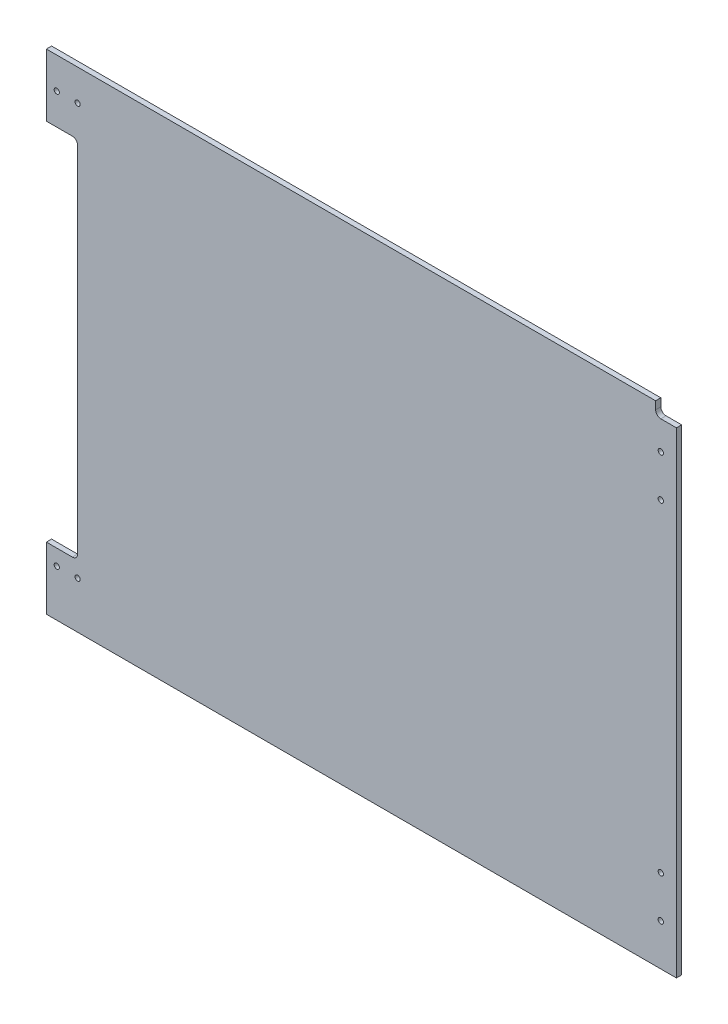
ISO-10303-21;
HEADER;
FILE_DESCRIPTION(('STEP AP214'),'2;1');
FILE_NAME('part.step','',(''),(''),'','','');
FILE_SCHEMA(('AUTOMOTIVE_DESIGN { 1 0 10303 214 1 1 1 1 }'));
ENDSEC;
DATA;
#1=APPLICATION_CONTEXT('core data for automotive mechanical design processes');
#2=APPLICATION_PROTOCOL_DEFINITION('international standard','automotive_design',2000,#1);
#3=PRODUCT_CONTEXT('',#1,'mechanical');
#4=PRODUCT('Part','Part','',(#3));
#5=PRODUCT_RELATED_PRODUCT_CATEGORY('part','',(#4));
#6=PRODUCT_DEFINITION_FORMATION('','',#4);
#7=PRODUCT_DEFINITION_CONTEXT('part definition',#1,'design');
#8=PRODUCT_DEFINITION('design','',#6,#7);
#9=PRODUCT_DEFINITION_SHAPE('','',#8);
#10=(LENGTH_UNIT() NAMED_UNIT(*) SI_UNIT(.MILLI.,.METRE.));
#11=(NAMED_UNIT(*) PLANE_ANGLE_UNIT() SI_UNIT($,.RADIAN.));
#12=(NAMED_UNIT(*) SI_UNIT($,.STERADIAN.) SOLID_ANGLE_UNIT());
#13=UNCERTAINTY_MEASURE_WITH_UNIT(LENGTH_MEASURE(1.E-05),#10,'distance_accuracy_value','');
#14=(GEOMETRIC_REPRESENTATION_CONTEXT(3) GLOBAL_UNCERTAINTY_ASSIGNED_CONTEXT((#13)) GLOBAL_UNIT_ASSIGNED_CONTEXT((#10,
#11,#12)) REPRESENTATION_CONTEXT('',''));
#15=CARTESIAN_POINT('',(0.,0.,0.));
#16=DIRECTION('',(0.,0.,1.));
#17=DIRECTION('',(1.,0.,0.));
#18=AXIS2_PLACEMENT_3D('',#15,#16,#17);
#19=CARTESIAN_POINT('',(0.,0.,6.35));
#20=DIRECTION('',(0.,0.,-1.));
#21=DIRECTION('',(-1.,0.,0.));
#22=AXIS2_PLACEMENT_3D('',#19,#20,#21);
#23=PLANE('',#22);
#24=CARTESIAN_POINT('',(-387.35,260.35,6.35));
#25=DIRECTION('',(0.,0.,1.));
#26=DIRECTION('',(1.,0.,0.));
#27=AXIS2_PLACEMENT_3D('',#24,#25,#26);
#28=CIRCLE('',#27,3.17499999999998);
#29=CARTESIAN_POINT('',(-384.175,260.35,6.35));
#30=VERTEX_POINT('',#29);
#31=EDGE_CURVE('E206',#30,#30,#28,.T.);
#32=ORIENTED_EDGE('',*,*,#31,.F.);
#33=EDGE_LOOP('',(#32));
#34=FACE_BOUND('',#33,.T.);
#35=CARTESIAN_POINT('',(-361.95,-241.3,6.35));
#36=DIRECTION('',(0.,0.,1.));
#37=DIRECTION('',(1.,0.,0.));
#38=AXIS2_PLACEMENT_3D('',#35,#36,#37);
#39=CIRCLE('',#38,3.17499999999998);
#40=CARTESIAN_POINT('',(-358.775,-241.3,6.35));
#41=VERTEX_POINT('',#40);
#42=EDGE_CURVE('E226',#41,#41,#39,.T.);
#43=ORIENTED_EDGE('',*,*,#42,.F.);
#44=EDGE_LOOP('',(#43));
#45=FACE_BOUND('',#44,.T.);
#46=CARTESIAN_POINT('',(349.25,247.65,6.35));
#47=DIRECTION('',(0.,0.,1.));
#48=DIRECTION('',(1.,0.,0.));
#49=AXIS2_PLACEMENT_3D('',#46,#47,#48);
#50=CIRCLE('',#49,3.26389999999999);
#51=CARTESIAN_POINT('',(352.5139,247.65,6.35));
#52=VERTEX_POINT('',#51);
#53=EDGE_CURVE('E242',#52,#52,#50,.T.);
#54=ORIENTED_EDGE('',*,*,#53,.F.);
#55=EDGE_LOOP('',(#54));
#56=FACE_BOUND('',#55,.T.);
#57=CARTESIAN_POINT('',(349.25,196.85,6.35));
#58=DIRECTION('',(0.,0.,1.));
#59=DIRECTION('',(1.,0.,0.));
#60=AXIS2_PLACEMENT_3D('',#57,#58,#59);
#61=CIRCLE('',#60,3.26389999999999);
#62=CARTESIAN_POINT('',(352.5139,196.85,6.35));
#63=VERTEX_POINT('',#62);
#64=EDGE_CURVE('E250',#63,#63,#61,.T.);
#65=ORIENTED_EDGE('',*,*,#64,.F.);
#66=EDGE_LOOP('',(#65));
#67=FACE_BOUND('',#66,.T.);
#68=CARTESIAN_POINT('',(349.25,-196.85,6.35));
#69=DIRECTION('',(0.,0.,1.));
#70=DIRECTION('',(1.,0.,0.));
#71=AXIS2_PLACEMENT_3D('',#68,#69,#70);
#72=CIRCLE('',#71,3.26389999999999);
#73=CARTESIAN_POINT('',(352.5139,-196.85,6.35));
#74=VERTEX_POINT('',#73);
#75=EDGE_CURVE('E258',#74,#74,#72,.T.);
#76=ORIENTED_EDGE('',*,*,#75,.F.);
#77=EDGE_LOOP('',(#76));
#78=FACE_BOUND('',#77,.T.);
#79=DIRECTION('',(0.,1.,0.));
#80=VECTOR('',#79,1.);
#81=CARTESIAN_POINT('',(368.3,-298.45,6.35));
#82=LINE('',#81,#80);
#83=CARTESIAN_POINT('',(368.3,-298.45,6.35));
#84=VERTEX_POINT('',#83);
#85=CARTESIAN_POINT('',(368.3,282.575,6.35));
#86=VERTEX_POINT('',#85);
#87=EDGE_CURVE('E328',#84,#86,#82,.T.);
#88=ORIENTED_EDGE('',*,*,#87,.T.);
#89=DIRECTION('',(1.,0.,0.));
#90=VECTOR('',#89,1.);
#91=CARTESIAN_POINT('',(368.3,282.575,6.35));
#92=LINE('',#91,#90);
#93=CARTESIAN_POINT('',(349.25,282.575,6.35));
#94=VERTEX_POINT('',#93);
#95=EDGE_CURVE('E190',#94,#86,#92,.T.);
#96=ORIENTED_EDGE('',*,*,#95,.F.);
#97=CARTESIAN_POINT('',(349.25,288.925,6.35));
#98=DIRECTION('',(0.,0.,1.));
#99=DIRECTION('',(-1.,0.,0.));
#100=AXIS2_PLACEMENT_3D('',#97,#98,#99);
#101=CIRCLE('',#100,6.35000000000002);
#102=CARTESIAN_POINT('',(342.9,288.925,6.35));
#103=VERTEX_POINT('',#102);
#104=EDGE_CURVE('E194',#103,#94,#101,.T.);
#105=ORIENTED_EDGE('',*,*,#104,.F.);
#106=DIRECTION('',(0.,-1.,0.));
#107=VECTOR('',#106,1.);
#108=CARTESIAN_POINT('',(342.9,298.45,6.35));
#109=LINE('',#108,#107);
#110=CARTESIAN_POINT('',(342.9,298.45,6.35));
#111=VERTEX_POINT('',#110);
#112=EDGE_CURVE('E167',#111,#103,#109,.T.);
#113=ORIENTED_EDGE('',*,*,#112,.F.);
#114=DIRECTION('',(-1.,0.,0.));
#115=VECTOR('',#114,1.);
#116=CARTESIAN_POINT('',(-368.3,298.45,6.35));
#117=LINE('',#116,#115);
#118=CARTESIAN_POINT('',(-400.05,298.45,6.35));
#119=VERTEX_POINT('',#118);
#120=EDGE_CURVE('E332',#111,#119,#117,.T.);
#121=ORIENTED_EDGE('',*,*,#120,.T.);
#122=DIRECTION('',(0.,-1.,0.));
#123=VECTOR('',#122,1.);
#124=CARTESIAN_POINT('',(-400.05,298.45,6.35));
#125=LINE('',#124,#123);
#126=CARTESIAN_POINT('',(-400.05,222.25,6.35));
#127=VERTEX_POINT('',#126);
#128=EDGE_CURVE('E301',#119,#127,#125,.T.);
#129=ORIENTED_EDGE('',*,*,#128,.T.);
#130=DIRECTION('',(1.,0.,0.));
#131=VECTOR('',#130,1.);
#132=CARTESIAN_POINT('',(-368.3,222.25,6.35));
#133=LINE('',#132,#131);
#134=CARTESIAN_POINT('',(-368.3,222.25,6.35));
#135=VERTEX_POINT('',#134);
#136=EDGE_CURVE('E305',#127,#135,#133,.T.);
#137=ORIENTED_EDGE('',*,*,#136,.T.);
#138=CARTESIAN_POINT('',(-368.3,215.9,6.34999999999999));
#139=DIRECTION('',(0.,0.,-1.));
#140=DIRECTION('',(-1.,0.,0.));
#141=AXIS2_PLACEMENT_3D('',#138,#139,#140);
#142=CIRCLE('',#141,6.35);
#143=CARTESIAN_POINT('',(-361.95,215.9,6.35));
#144=VERTEX_POINT('',#143);
#145=EDGE_CURVE('E363',#135,#144,#142,.T.);
#146=ORIENTED_EDGE('',*,*,#145,.T.);
#147=DIRECTION('',(0.,1.,0.));
#148=VECTOR('',#147,1.);
#149=CARTESIAN_POINT('',(-361.95,222.25,6.35));
#150=LINE('',#149,#148);
#151=CARTESIAN_POINT('',(-361.95,-215.9,6.35));
#152=VERTEX_POINT('',#151);
#153=EDGE_CURVE('E274',#152,#144,#150,.T.);
#154=ORIENTED_EDGE('',*,*,#153,.F.);
#155=CARTESIAN_POINT('',(-368.3,-215.9,6.35));
#156=DIRECTION('',(0.,0.,-1.));
#157=DIRECTION('',(-1.,0.,0.));
#158=AXIS2_PLACEMENT_3D('',#155,#156,#157);
#159=CIRCLE('',#158,6.35);
#160=CARTESIAN_POINT('',(-368.3,-222.25,6.35));
#161=VERTEX_POINT('',#160);
#162=EDGE_CURVE('E48',#152,#161,#159,.T.);
#163=ORIENTED_EDGE('',*,*,#162,.T.);
#164=DIRECTION('',(-1.,0.,0.));
#165=VECTOR('',#164,1.);
#166=CARTESIAN_POINT('',(-368.3,-222.25,6.35));
#167=LINE('',#166,#165);
#168=CARTESIAN_POINT('',(-400.05,-222.25,6.35));
#169=VERTEX_POINT('',#168);
#170=EDGE_CURVE('E279',#161,#169,#167,.T.);
#171=ORIENTED_EDGE('',*,*,#170,.T.);
#172=DIRECTION('',(0.,-1.,0.));
#173=VECTOR('',#172,1.);
#174=CARTESIAN_POINT('',(-400.05,-298.45,6.35));
#175=LINE('',#174,#173);
#176=CARTESIAN_POINT('',(-400.05,-298.45,6.35));
#177=VERTEX_POINT('',#176);
#178=EDGE_CURVE('E283',#169,#177,#175,.T.);
#179=ORIENTED_EDGE('',*,*,#178,.T.);
#180=DIRECTION('',(1.,0.,0.));
#181=VECTOR('',#180,1.);
#182=CARTESIAN_POINT('',(-368.3,-298.45,6.35));
#183=LINE('',#182,#181);
#184=EDGE_CURVE('E336',#177,#84,#183,.T.);
#185=ORIENTED_EDGE('',*,*,#184,.T.);
#186=EDGE_LOOP('',(#88,#96,#105,#113,#121,#129,#137,#146,#154,#163,#171,#179,#185));
#187=FACE_BOUND('',#186,.T.);
#188=CARTESIAN_POINT('',(349.25,-247.65,6.35));
#189=DIRECTION('',(0.,0.,1.));
#190=DIRECTION('',(1.,0.,0.));
#191=AXIS2_PLACEMENT_3D('',#188,#189,#190);
#192=CIRCLE('',#191,3.26389999999999);
#193=CARTESIAN_POINT('',(352.5139,-247.65,6.35));
#194=VERTEX_POINT('',#193);
#195=EDGE_CURVE('E266',#194,#194,#192,.T.);
#196=ORIENTED_EDGE('',*,*,#195,.F.);
#197=EDGE_LOOP('',(#196));
#198=FACE_BOUND('',#197,.T.);
#199=CARTESIAN_POINT('',(-387.35,-241.3,6.35));
#200=DIRECTION('',(0.,0.,1.));
#201=DIRECTION('',(1.,0.,0.));
#202=AXIS2_PLACEMENT_3D('',#199,#200,#201);
#203=CIRCLE('',#202,3.17499999999998);
#204=CARTESIAN_POINT('',(-384.175,-241.3,6.35));
#205=VERTEX_POINT('',#204);
#206=EDGE_CURVE('E234',#205,#205,#203,.T.);
#207=ORIENTED_EDGE('',*,*,#206,.F.);
#208=EDGE_LOOP('',(#207));
#209=FACE_BOUND('',#208,.T.);
#210=CARTESIAN_POINT('',(-361.95,260.35,6.35));
#211=DIRECTION('',(0.,0.,1.));
#212=DIRECTION('',(1.,0.,0.));
#213=AXIS2_PLACEMENT_3D('',#210,#211,#212);
#214=CIRCLE('',#213,3.17499999999998);
#215=CARTESIAN_POINT('',(-358.775,260.35,6.35));
#216=VERTEX_POINT('',#215);
#217=EDGE_CURVE('E218',#216,#216,#214,.T.);
#218=ORIENTED_EDGE('',*,*,#217,.F.);
#219=EDGE_LOOP('',(#218));
#220=FACE_BOUND('',#219,.T.);
#221=ADVANCED_FACE('F39',(#34,#45,#56,#67,#78,#187,#198,#209,#220),#23,.F.);
#222=CARTESIAN_POINT('',(0.,0.,0.));
#223=DIRECTION('',(0.,0.,-1.));
#224=DIRECTION('',(-1.,0.,0.));
#225=AXIS2_PLACEMENT_3D('',#222,#223,#224);
#226=PLANE('',#225);
#227=DIRECTION('',(1.,0.,0.));
#228=VECTOR('',#227,1.);
#229=CARTESIAN_POINT('',(368.3,282.575,0.));
#230=LINE('',#229,#228);
#231=CARTESIAN_POINT('',(349.25,282.575,0.));
#232=VERTEX_POINT('',#231);
#233=CARTESIAN_POINT('',(368.3,282.575,0.));
#234=VERTEX_POINT('',#233);
#235=EDGE_CURVE('E182',#232,#234,#230,.T.);
#236=ORIENTED_EDGE('',*,*,#235,.T.);
#237=DIRECTION('',(0.,1.,0.));
#238=VECTOR('',#237,1.);
#239=CARTESIAN_POINT('',(368.3,-298.45,0.));
#240=LINE('',#239,#238);
#241=CARTESIAN_POINT('',(368.3,-298.45,0.));
#242=VERTEX_POINT('',#241);
#243=EDGE_CURVE('E317',#242,#234,#240,.T.);
#244=ORIENTED_EDGE('',*,*,#243,.F.);
#245=DIRECTION('',(1.,0.,0.));
#246=VECTOR('',#245,1.);
#247=CARTESIAN_POINT('',(-368.3,-298.45,0.));
#248=LINE('',#247,#246);
#249=CARTESIAN_POINT('',(-400.05,-298.45,0.));
#250=VERTEX_POINT('',#249);
#251=EDGE_CURVE('E333',#250,#242,#248,.T.);
#252=ORIENTED_EDGE('',*,*,#251,.F.);
#253=DIRECTION('',(0.,-1.,0.));
#254=VECTOR('',#253,1.);
#255=CARTESIAN_POINT('',(-400.05,-298.45,0.));
#256=LINE('',#255,#254);
#257=CARTESIAN_POINT('',(-400.05,-222.25,0.));
#258=VERTEX_POINT('',#257);
#259=EDGE_CURVE('E293',#258,#250,#256,.T.);
#260=ORIENTED_EDGE('',*,*,#259,.F.);
#261=DIRECTION('',(-1.,0.,0.));
#262=VECTOR('',#261,1.);
#263=CARTESIAN_POINT('',(-368.3,-222.25,0.));
#264=LINE('',#263,#262);
#265=CARTESIAN_POINT('',(-368.3,-222.25,0.));
#266=VERTEX_POINT('',#265);
#267=EDGE_CURVE('E287',#266,#258,#264,.T.);
#268=ORIENTED_EDGE('',*,*,#267,.F.);
#269=CARTESIAN_POINT('',(-368.3,-215.9,0.));
#270=DIRECTION('',(0.,0.,-1.));
#271=DIRECTION('',(-1.,0.,0.));
#272=AXIS2_PLACEMENT_3D('',#269,#270,#271);
#273=CIRCLE('',#272,6.35);
#274=CARTESIAN_POINT('',(-361.95,-215.9,0.));
#275=VERTEX_POINT('',#274);
#276=EDGE_CURVE('E11',#266,#275,#273,.F.);
#277=ORIENTED_EDGE('',*,*,#276,.T.);
#278=DIRECTION('',(0.,1.,0.));
#279=VECTOR('',#278,1.);
#280=CARTESIAN_POINT('',(-361.95,222.25,0.));
#281=LINE('',#280,#279);
#282=CARTESIAN_POINT('',(-361.95,215.9,0.));
#283=VERTEX_POINT('',#282);
#284=EDGE_CURVE('E275',#275,#283,#281,.T.);
#285=ORIENTED_EDGE('',*,*,#284,.T.);
#286=CARTESIAN_POINT('',(-368.3,215.9,0.));
#287=DIRECTION('',(0.,0.,-1.));
#288=DIRECTION('',(-1.,0.,0.));
#289=AXIS2_PLACEMENT_3D('',#286,#287,#288);
#290=CIRCLE('',#289,6.35);
#291=CARTESIAN_POINT('',(-368.3,222.25,0.));
#292=VERTEX_POINT('',#291);
#293=EDGE_CURVE('E366',#283,#292,#290,.F.);
#294=ORIENTED_EDGE('',*,*,#293,.T.);
#295=DIRECTION('',(1.,0.,0.));
#296=VECTOR('',#295,1.);
#297=CARTESIAN_POINT('',(-368.3,222.25,0.));
#298=LINE('',#297,#296);
#299=CARTESIAN_POINT('',(-400.05,222.25,0.));
#300=VERTEX_POINT('',#299);
#301=EDGE_CURVE('E313',#300,#292,#298,.T.);
#302=ORIENTED_EDGE('',*,*,#301,.F.);
#303=DIRECTION('',(0.,-1.,0.));
#304=VECTOR('',#303,1.);
#305=CARTESIAN_POINT('',(-400.05,298.45,0.));
#306=LINE('',#305,#304);
#307=CARTESIAN_POINT('',(-400.05,298.45,0.));
#308=VERTEX_POINT('',#307);
#309=EDGE_CURVE('E319',#308,#300,#306,.T.);
#310=ORIENTED_EDGE('',*,*,#309,.F.);
#311=DIRECTION('',(-1.,0.,0.));
#312=VECTOR('',#311,1.);
#313=CARTESIAN_POINT('',(-368.3,298.45,0.));
#314=LINE('',#313,#312);
#315=CARTESIAN_POINT('',(342.9,298.45,0.));
#316=VERTEX_POINT('',#315);
#317=EDGE_CURVE('E188',#316,#308,#314,.T.);
#318=ORIENTED_EDGE('',*,*,#317,.F.);
#319=DIRECTION('',(0.,-1.,0.));
#320=VECTOR('',#319,1.);
#321=CARTESIAN_POINT('',(342.9,298.45,0.));
#322=LINE('',#321,#320);
#323=CARTESIAN_POINT('',(342.9,288.925,0.));
#324=VERTEX_POINT('',#323);
#325=EDGE_CURVE('E59',#316,#324,#322,.T.);
#326=ORIENTED_EDGE('',*,*,#325,.T.);
#327=CARTESIAN_POINT('',(349.25,288.925,0.));
#328=DIRECTION('',(0.,0.,1.));
#329=DIRECTION('',(-1.,0.,0.));
#330=AXIS2_PLACEMENT_3D('',#327,#328,#329);
#331=CIRCLE('',#330,6.35000000000002);
#332=EDGE_CURVE('E176',#324,#232,#331,.T.);
#333=ORIENTED_EDGE('',*,*,#332,.T.);
#334=EDGE_LOOP('',(#236,#244,#252,#260,#268,#277,#285,#294,#302,#310,#318,#326,#333));
#335=FACE_BOUND('',#334,.T.);
#336=CARTESIAN_POINT('',(-387.35,260.35,0.));
#337=DIRECTION('',(0.,0.,-1.));
#338=DIRECTION('',(-1.,0.,0.));
#339=AXIS2_PLACEMENT_3D('',#336,#337,#338);
#340=CIRCLE('',#339,3.17499999999998);
#341=CARTESIAN_POINT('',(-390.525,260.35,0.));
#342=VERTEX_POINT('',#341);
#343=EDGE_CURVE('E214',#342,#342,#340,.F.);
#344=ORIENTED_EDGE('',*,*,#343,.T.);
#345=EDGE_LOOP('',(#344));
#346=FACE_BOUND('',#345,.T.);
#347=CARTESIAN_POINT('',(-361.95,260.35,0.));
#348=DIRECTION('',(0.,0.,-1.));
#349=DIRECTION('',(-1.,0.,0.));
#350=AXIS2_PLACEMENT_3D('',#347,#348,#349);
#351=CIRCLE('',#350,3.17499999999998);
#352=CARTESIAN_POINT('',(-365.125,260.35,0.));
#353=VERTEX_POINT('',#352);
#354=EDGE_CURVE('E222',#353,#353,#351,.F.);
#355=ORIENTED_EDGE('',*,*,#354,.T.);
#356=EDGE_LOOP('',(#355));
#357=FACE_BOUND('',#356,.T.);
#358=CARTESIAN_POINT('',(-361.95,-241.3,0.));
#359=DIRECTION('',(0.,0.,-1.));
#360=DIRECTION('',(-1.,0.,0.));
#361=AXIS2_PLACEMENT_3D('',#358,#359,#360);
#362=CIRCLE('',#361,3.17499999999998);
#363=CARTESIAN_POINT('',(-365.125,-241.3,0.));
#364=VERTEX_POINT('',#363);
#365=EDGE_CURVE('E230',#364,#364,#362,.F.);
#366=ORIENTED_EDGE('',*,*,#365,.T.);
#367=EDGE_LOOP('',(#366));
#368=FACE_BOUND('',#367,.T.);
#369=CARTESIAN_POINT('',(349.25,196.85,0.));
#370=DIRECTION('',(0.,0.,1.));
#371=DIRECTION('',(1.,0.,0.));
#372=AXIS2_PLACEMENT_3D('',#369,#370,#371);
#373=CIRCLE('',#372,3.26389999999999);
#374=CARTESIAN_POINT('',(352.5139,196.85,0.));
#375=VERTEX_POINT('',#374);
#376=EDGE_CURVE('E254',#375,#375,#373,.T.);
#377=ORIENTED_EDGE('',*,*,#376,.T.);
#378=EDGE_LOOP('',(#377));
#379=FACE_BOUND('',#378,.T.);
#380=CARTESIAN_POINT('',(349.25,-196.85,0.));
#381=DIRECTION('',(0.,0.,1.));
#382=DIRECTION('',(1.,0.,0.));
#383=AXIS2_PLACEMENT_3D('',#380,#381,#382);
#384=CIRCLE('',#383,3.26389999999999);
#385=CARTESIAN_POINT('',(352.5139,-196.85,0.));
#386=VERTEX_POINT('',#385);
#387=EDGE_CURVE('E262',#386,#386,#384,.T.);
#388=ORIENTED_EDGE('',*,*,#387,.T.);
#389=EDGE_LOOP('',(#388));
#390=FACE_BOUND('',#389,.T.);
#391=CARTESIAN_POINT('',(349.25,-247.65,0.));
#392=DIRECTION('',(0.,0.,1.));
#393=DIRECTION('',(1.,0.,0.));
#394=AXIS2_PLACEMENT_3D('',#391,#392,#393);
#395=CIRCLE('',#394,3.26389999999999);
#396=CARTESIAN_POINT('',(352.5139,-247.65,0.));
#397=VERTEX_POINT('',#396);
#398=EDGE_CURVE('E270',#397,#397,#395,.T.);
#399=ORIENTED_EDGE('',*,*,#398,.T.);
#400=EDGE_LOOP('',(#399));
#401=FACE_BOUND('',#400,.T.);
#402=CARTESIAN_POINT('',(349.25,247.65,0.));
#403=DIRECTION('',(0.,0.,1.));
#404=DIRECTION('',(1.,0.,0.));
#405=AXIS2_PLACEMENT_3D('',#402,#403,#404);
#406=CIRCLE('',#405,3.26389999999999);
#407=CARTESIAN_POINT('',(352.5139,247.65,0.));
#408=VERTEX_POINT('',#407);
#409=EDGE_CURVE('E246',#408,#408,#406,.T.);
#410=ORIENTED_EDGE('',*,*,#409,.T.);
#411=EDGE_LOOP('',(#410));
#412=FACE_BOUND('',#411,.T.);
#413=CARTESIAN_POINT('',(-387.35,-241.3,0.));
#414=DIRECTION('',(0.,0.,-1.));
#415=DIRECTION('',(-1.,0.,0.));
#416=AXIS2_PLACEMENT_3D('',#413,#414,#415);
#417=CIRCLE('',#416,3.17499999999998);
#418=CARTESIAN_POINT('',(-390.525,-241.3,0.));
#419=VERTEX_POINT('',#418);
#420=EDGE_CURVE('E238',#419,#419,#417,.F.);
#421=ORIENTED_EDGE('',*,*,#420,.T.);
#422=EDGE_LOOP('',(#421));
#423=FACE_BOUND('',#422,.T.);
#424=ADVANCED_FACE('F185',(#335,#346,#357,#368,#379,#390,#401,#412,#423),#226,.T.);
#425=CARTESIAN_POINT('',(368.3,-298.45,6.35));
#426=DIRECTION('',(-1.,0.,0.));
#427=DIRECTION('',(0.,0.,1.));
#428=AXIS2_PLACEMENT_3D('',#425,#426,#427);
#429=PLANE('',#428);
#430=ORIENTED_EDGE('',*,*,#243,.T.);
#431=DIRECTION('',(0.,0.,1.));
#432=VECTOR('',#431,1.);
#433=CARTESIAN_POINT('',(368.3,282.575,0.));
#434=LINE('',#433,#432);
#435=EDGE_CURVE('E202',#234,#86,#434,.T.);
#436=ORIENTED_EDGE('',*,*,#435,.T.);
#437=ORIENTED_EDGE('',*,*,#87,.F.);
#438=DIRECTION('',(0.,0.,-1.));
#439=VECTOR('',#438,1.);
#440=CARTESIAN_POINT('',(368.3,-298.45,6.35));
#441=LINE('',#440,#439);
#442=EDGE_CURVE('E339',#84,#242,#441,.T.);
#443=ORIENTED_EDGE('',*,*,#442,.T.);
#444=EDGE_LOOP('',(#430,#436,#437,#443));
#445=FACE_BOUND('',#444,.T.);
#446=ADVANCED_FACE('F404',(#445),#429,.F.);
#447=CARTESIAN_POINT('',(-368.3,298.45,6.35));
#448=DIRECTION('',(0.,-1.,0.));
#449=DIRECTION('',(0.,0.,-1.));
#450=AXIS2_PLACEMENT_3D('',#447,#448,#449);
#451=PLANE('',#450);
#452=ORIENTED_EDGE('',*,*,#120,.F.);
#453=DIRECTION('',(0.,0.,1.));
#454=VECTOR('',#453,1.);
#455=CARTESIAN_POINT('',(342.9,298.45,0.));
#456=LINE('',#455,#454);
#457=EDGE_CURVE('E173',#316,#111,#456,.T.);
#458=ORIENTED_EDGE('',*,*,#457,.F.);
#459=ORIENTED_EDGE('',*,*,#317,.T.);
#460=DIRECTION('',(0.,0.,1.));
#461=VECTOR('',#460,1.);
#462=CARTESIAN_POINT('',(-400.05,298.45,-82.55));
#463=LINE('',#462,#461);
#464=EDGE_CURVE('E309',#308,#119,#463,.T.);
#465=ORIENTED_EDGE('',*,*,#464,.T.);
#466=EDGE_LOOP('',(#452,#458,#459,#465));
#467=FACE_BOUND('',#466,.T.);
#468=ADVANCED_FACE('F398',(#467),#451,.F.);
#469=CARTESIAN_POINT('',(-368.3,-298.45,6.35));
#470=DIRECTION('',(0.,1.,0.));
#471=DIRECTION('',(0.,0.,1.));
#472=AXIS2_PLACEMENT_3D('',#469,#470,#471);
#473=PLANE('',#472);
#474=ORIENTED_EDGE('',*,*,#251,.T.);
#475=ORIENTED_EDGE('',*,*,#442,.F.);
#476=ORIENTED_EDGE('',*,*,#184,.F.);
#477=DIRECTION('',(0.,0.,1.));
#478=VECTOR('',#477,1.);
#479=CARTESIAN_POINT('',(-400.05,-298.45,-82.55));
#480=LINE('',#479,#478);
#481=EDGE_CURVE('E297',#250,#177,#480,.T.);
#482=ORIENTED_EDGE('',*,*,#481,.F.);
#483=EDGE_LOOP('',(#474,#475,#476,#482));
#484=FACE_BOUND('',#483,.T.);
#485=ADVANCED_FACE('F409',(#484),#473,.F.);
#486=CARTESIAN_POINT('',(-400.05,298.45,-82.55));
#487=DIRECTION('',(-1.,0.,0.));
#488=DIRECTION('',(0.,-1.,0.));
#489=AXIS2_PLACEMENT_3D('',#486,#487,#488);
#490=PLANE('',#489);
#491=ORIENTED_EDGE('',*,*,#464,.F.);
#492=ORIENTED_EDGE('',*,*,#309,.T.);
#493=DIRECTION('',(0.,0.,1.));
#494=VECTOR('',#493,1.);
#495=CARTESIAN_POINT('',(-400.05,222.25,-82.55));
#496=LINE('',#495,#494);
#497=EDGE_CURVE('E318',#300,#127,#496,.T.);
#498=ORIENTED_EDGE('',*,*,#497,.T.);
#499=ORIENTED_EDGE('',*,*,#128,.F.);
#500=EDGE_LOOP('',(#491,#492,#498,#499));
#501=FACE_BOUND('',#500,.T.);
#502=ADVANCED_FACE('F395',(#501),#490,.T.);
#503=CARTESIAN_POINT('',(-368.3,222.25,-82.55));
#504=DIRECTION('',(0.,-1.,0.));
#505=DIRECTION('',(0.,0.,-1.));
#506=AXIS2_PLACEMENT_3D('',#503,#504,#505);
#507=PLANE('',#506);
#508=ORIENTED_EDGE('',*,*,#301,.T.);
#509=DIRECTION('',(0.,0.,1.));
#510=VECTOR('',#509,1.);
#511=CARTESIAN_POINT('',(-368.3,222.25,-82.55));
#512=LINE('',#511,#510);
#513=EDGE_CURVE('E350',#292,#135,#512,.T.);
#514=ORIENTED_EDGE('',*,*,#513,.T.);
#515=ORIENTED_EDGE('',*,*,#136,.F.);
#516=ORIENTED_EDGE('',*,*,#497,.F.);
#517=EDGE_LOOP('',(#508,#514,#515,#516));
#518=FACE_BOUND('',#517,.T.);
#519=ADVANCED_FACE('F390',(#518),#507,.T.);
#520=CARTESIAN_POINT('',(-368.3,-222.25,-82.55));
#521=DIRECTION('',(0.,1.,0.));
#522=DIRECTION('',(0.,0.,1.));
#523=AXIS2_PLACEMENT_3D('',#520,#521,#522);
#524=PLANE('',#523);
#525=ORIENTED_EDGE('',*,*,#170,.F.);
#526=DIRECTION('',(0.,0.,1.));
#527=VECTOR('',#526,1.);
#528=CARTESIAN_POINT('',(-368.3,-222.25,-82.55));
#529=LINE('',#528,#527);
#530=EDGE_CURVE('E69',#161,#266,#529,.F.);
#531=ORIENTED_EDGE('',*,*,#530,.T.);
#532=ORIENTED_EDGE('',*,*,#267,.T.);
#533=DIRECTION('',(0.,0.,1.));
#534=VECTOR('',#533,1.);
#535=CARTESIAN_POINT('',(-400.05,-222.25,-82.55));
#536=LINE('',#535,#534);
#537=EDGE_CURVE('E292',#258,#169,#536,.T.);
#538=ORIENTED_EDGE('',*,*,#537,.T.);
#539=EDGE_LOOP('',(#525,#531,#532,#538));
#540=FACE_BOUND('',#539,.T.);
#541=ADVANCED_FACE('F375',(#540),#524,.T.);
#542=CARTESIAN_POINT('',(-400.05,-298.45,-82.55));
#543=DIRECTION('',(-1.,0.,0.));
#544=DIRECTION('',(0.,0.,1.));
#545=AXIS2_PLACEMENT_3D('',#542,#543,#544);
#546=PLANE('',#545);
#547=ORIENTED_EDGE('',*,*,#537,.F.);
#548=ORIENTED_EDGE('',*,*,#259,.T.);
#549=ORIENTED_EDGE('',*,*,#481,.T.);
#550=ORIENTED_EDGE('',*,*,#178,.F.);
#551=EDGE_LOOP('',(#547,#548,#549,#550));
#552=FACE_BOUND('',#551,.T.);
#553=ADVANCED_FACE('F411',(#552),#546,.T.);
#554=CARTESIAN_POINT('',(-361.95,222.25,0.));
#555=DIRECTION('',(1.,0.,0.));
#556=DIRECTION('',(0.,1.,0.));
#557=AXIS2_PLACEMENT_3D('',#554,#555,#556);
#558=PLANE('',#557);
#559=ORIENTED_EDGE('',*,*,#153,.T.);
#560=DIRECTION('',(0.,0.,1.));
#561=VECTOR('',#560,1.);
#562=CARTESIAN_POINT('',(-361.95,215.9,0.));
#563=LINE('',#562,#561);
#564=EDGE_CURVE('E358',#144,#283,#563,.F.);
#565=ORIENTED_EDGE('',*,*,#564,.T.);
#566=ORIENTED_EDGE('',*,*,#284,.F.);
#567=DIRECTION('',(0.,0.,1.));
#568=VECTOR('',#567,1.);
#569=CARTESIAN_POINT('',(-361.95,-215.9,0.));
#570=LINE('',#569,#568);
#571=EDGE_CURVE('E354',#275,#152,#570,.T.);
#572=ORIENTED_EDGE('',*,*,#571,.T.);
#573=EDGE_LOOP('',(#559,#565,#566,#572));
#574=FACE_BOUND('',#573,.T.);
#575=ADVANCED_FACE('F383',(#574),#558,.F.);
#576=CARTESIAN_POINT('',(-368.3,215.9,-82.55));
#577=DIRECTION('',(0.,0.,1.));
#578=DIRECTION('',(1.,0.,0.));
#579=AXIS2_PLACEMENT_3D('',#576,#577,#578);
#580=CYLINDRICAL_SURFACE('',#579,6.35);
#581=ORIENTED_EDGE('',*,*,#293,.F.);
#582=ORIENTED_EDGE('',*,*,#564,.F.);
#583=ORIENTED_EDGE('',*,*,#145,.F.);
#584=ORIENTED_EDGE('',*,*,#513,.F.);
#585=EDGE_LOOP('',(#581,#582,#583,#584));
#586=FACE_BOUND('',#585,.T.);
#587=ADVANCED_FACE('F386',(#586),#580,.F.);
#588=CARTESIAN_POINT('',(-368.3,-215.9,0.));
#589=DIRECTION('',(0.,0.,1.));
#590=DIRECTION('',(1.,0.,0.));
#591=AXIS2_PLACEMENT_3D('',#588,#589,#590);
#592=CYLINDRICAL_SURFACE('',#591,6.35);
#593=ORIENTED_EDGE('',*,*,#276,.F.);
#594=ORIENTED_EDGE('',*,*,#530,.F.);
#595=ORIENTED_EDGE('',*,*,#162,.F.);
#596=ORIENTED_EDGE('',*,*,#571,.F.);
#597=EDGE_LOOP('',(#593,#594,#595,#596));
#598=FACE_BOUND('',#597,.T.);
#599=ADVANCED_FACE('F41',(#598),#592,.F.);
#600=CARTESIAN_POINT('',(349.25,-247.65,6.35));
#601=DIRECTION('',(0.,0.,1.));
#602=DIRECTION('',(1.,0.,0.));
#603=AXIS2_PLACEMENT_3D('',#600,#601,#602);
#604=CYLINDRICAL_SURFACE('',#603,3.26389999999999);
#605=ORIENTED_EDGE('',*,*,#398,.F.);
#606=EDGE_LOOP('',(#605));
#607=FACE_BOUND('',#606,.T.);
#608=ORIENTED_EDGE('',*,*,#195,.T.);
#609=EDGE_LOOP('',(#608));
#610=FACE_BOUND('',#609,.T.);
#611=ADVANCED_FACE('F441',(#607,#610),#604,.F.);
#612=CARTESIAN_POINT('',(349.25,-196.85,6.35));
#613=DIRECTION('',(0.,0.,1.));
#614=DIRECTION('',(1.,0.,0.));
#615=AXIS2_PLACEMENT_3D('',#612,#613,#614);
#616=CYLINDRICAL_SURFACE('',#615,3.26389999999999);
#617=ORIENTED_EDGE('',*,*,#387,.F.);
#618=EDGE_LOOP('',(#617));
#619=FACE_BOUND('',#618,.T.);
#620=ORIENTED_EDGE('',*,*,#75,.T.);
#621=EDGE_LOOP('',(#620));
#622=FACE_BOUND('',#621,.T.);
#623=ADVANCED_FACE('F445',(#619,#622),#616,.F.);
#624=CARTESIAN_POINT('',(349.25,196.85,6.35));
#625=DIRECTION('',(0.,0.,1.));
#626=DIRECTION('',(1.,0.,0.));
#627=AXIS2_PLACEMENT_3D('',#624,#625,#626);
#628=CYLINDRICAL_SURFACE('',#627,3.26389999999999);
#629=ORIENTED_EDGE('',*,*,#376,.F.);
#630=EDGE_LOOP('',(#629));
#631=FACE_BOUND('',#630,.T.);
#632=ORIENTED_EDGE('',*,*,#64,.T.);
#633=EDGE_LOOP('',(#632));
#634=FACE_BOUND('',#633,.T.);
#635=ADVANCED_FACE('F451',(#631,#634),#628,.F.);
#636=CARTESIAN_POINT('',(349.25,247.65,6.35));
#637=DIRECTION('',(0.,0.,1.));
#638=DIRECTION('',(1.,0.,0.));
#639=AXIS2_PLACEMENT_3D('',#636,#637,#638);
#640=CYLINDRICAL_SURFACE('',#639,3.26389999999999);
#641=ORIENTED_EDGE('',*,*,#409,.F.);
#642=EDGE_LOOP('',(#641));
#643=FACE_BOUND('',#642,.T.);
#644=ORIENTED_EDGE('',*,*,#53,.T.);
#645=EDGE_LOOP('',(#644));
#646=FACE_BOUND('',#645,.T.);
#647=ADVANCED_FACE('F459',(#643,#646),#640,.F.);
#648=CARTESIAN_POINT('',(-387.35,-241.3,6.35));
#649=DIRECTION('',(0.,0.,1.));
#650=DIRECTION('',(1.,0.,0.));
#651=AXIS2_PLACEMENT_3D('',#648,#649,#650);
#652=CYLINDRICAL_SURFACE('',#651,3.17499999999998);
#653=ORIENTED_EDGE('',*,*,#420,.F.);
#654=EDGE_LOOP('',(#653));
#655=FACE_BOUND('',#654,.T.);
#656=ORIENTED_EDGE('',*,*,#206,.T.);
#657=EDGE_LOOP('',(#656));
#658=FACE_BOUND('',#657,.T.);
#659=ADVANCED_FACE('F463',(#655,#658),#652,.F.);
#660=CARTESIAN_POINT('',(-361.95,-241.3,6.35));
#661=DIRECTION('',(0.,0.,1.));
#662=DIRECTION('',(1.,0.,0.));
#663=AXIS2_PLACEMENT_3D('',#660,#661,#662);
#664=CYLINDRICAL_SURFACE('',#663,3.17499999999998);
#665=ORIENTED_EDGE('',*,*,#365,.F.);
#666=EDGE_LOOP('',(#665));
#667=FACE_BOUND('',#666,.T.);
#668=ORIENTED_EDGE('',*,*,#42,.T.);
#669=EDGE_LOOP('',(#668));
#670=FACE_BOUND('',#669,.T.);
#671=ADVANCED_FACE('F467',(#667,#670),#664,.F.);
#672=CARTESIAN_POINT('',(-361.95,260.35,6.35));
#673=DIRECTION('',(0.,0.,1.));
#674=DIRECTION('',(1.,0.,0.));
#675=AXIS2_PLACEMENT_3D('',#672,#673,#674);
#676=CYLINDRICAL_SURFACE('',#675,3.17499999999998);
#677=ORIENTED_EDGE('',*,*,#354,.F.);
#678=EDGE_LOOP('',(#677));
#679=FACE_BOUND('',#678,.T.);
#680=ORIENTED_EDGE('',*,*,#217,.T.);
#681=EDGE_LOOP('',(#680));
#682=FACE_BOUND('',#681,.T.);
#683=ADVANCED_FACE('F471',(#679,#682),#676,.F.);
#684=CARTESIAN_POINT('',(-387.35,260.35,6.35));
#685=DIRECTION('',(0.,0.,1.));
#686=DIRECTION('',(1.,0.,0.));
#687=AXIS2_PLACEMENT_3D('',#684,#685,#686);
#688=CYLINDRICAL_SURFACE('',#687,3.17499999999998);
#689=ORIENTED_EDGE('',*,*,#343,.F.);
#690=EDGE_LOOP('',(#689));
#691=FACE_BOUND('',#690,.T.);
#692=ORIENTED_EDGE('',*,*,#31,.T.);
#693=EDGE_LOOP('',(#692));
#694=FACE_BOUND('',#693,.T.);
#695=ADVANCED_FACE('F475',(#691,#694),#688,.F.);
#696=CARTESIAN_POINT('',(368.3,282.575,0.));
#697=DIRECTION('',(0.,-1.,0.));
#698=DIRECTION('',(0.,0.,-1.));
#699=AXIS2_PLACEMENT_3D('',#696,#697,#698);
#700=PLANE('',#699);
#701=ORIENTED_EDGE('',*,*,#95,.T.);
#702=ORIENTED_EDGE('',*,*,#435,.F.);
#703=ORIENTED_EDGE('',*,*,#235,.F.);
#704=DIRECTION('',(0.,0.,1.));
#705=VECTOR('',#704,1.);
#706=CARTESIAN_POINT('',(349.25,282.575,0.));
#707=LINE('',#706,#705);
#708=EDGE_CURVE('E172',#232,#94,#707,.T.);
#709=ORIENTED_EDGE('',*,*,#708,.T.);
#710=EDGE_LOOP('',(#701,#702,#703,#709));
#711=FACE_BOUND('',#710,.T.);
#712=ADVANCED_FACE('F402',(#711),#700,.F.);
#713=CARTESIAN_POINT('',(349.25,288.925,0.));
#714=DIRECTION('',(0.,0.,1.));
#715=DIRECTION('',(1.,0.,0.));
#716=AXIS2_PLACEMENT_3D('',#713,#714,#715);
#717=CYLINDRICAL_SURFACE('',#716,6.35000000000002);
#718=ORIENTED_EDGE('',*,*,#104,.T.);
#719=ORIENTED_EDGE('',*,*,#708,.F.);
#720=ORIENTED_EDGE('',*,*,#332,.F.);
#721=DIRECTION('',(0.,0.,1.));
#722=VECTOR('',#721,1.);
#723=CARTESIAN_POINT('',(342.9,288.925,0.));
#724=LINE('',#723,#722);
#725=EDGE_CURVE('E163',#324,#103,#724,.T.);
#726=ORIENTED_EDGE('',*,*,#725,.T.);
#727=EDGE_LOOP('',(#718,#719,#720,#726));
#728=FACE_BOUND('',#727,.T.);
#729=ADVANCED_FACE('F177',(#728),#717,.F.);
#730=CARTESIAN_POINT('',(342.9,298.45,0.));
#731=DIRECTION('',(-1.,0.,0.));
#732=DIRECTION('',(0.,0.,1.));
#733=AXIS2_PLACEMENT_3D('',#730,#731,#732);
#734=PLANE('',#733);
#735=ORIENTED_EDGE('',*,*,#112,.T.);
#736=ORIENTED_EDGE('',*,*,#725,.F.);
#737=ORIENTED_EDGE('',*,*,#325,.F.);
#738=ORIENTED_EDGE('',*,*,#457,.T.);
#739=EDGE_LOOP('',(#735,#736,#737,#738));
#740=FACE_BOUND('',#739,.T.);
#741=ADVANCED_FACE('F165',(#740),#734,.F.);
#742=CLOSED_SHELL('',(#221,#424,#446,#468,#485,#502,#519,#541,#553,#575,#587,#599,#611,#623,
#635,#647,#659,#671,#683,#695,#712,#729,#741));
#743=MANIFOLD_SOLID_BREP('B2',#742);
#744=ADVANCED_BREP_SHAPE_REPRESENTATION('',(#18,#743),#14);
#745=SHAPE_DEFINITION_REPRESENTATION(#9,#744);
ENDSEC;
END-ISO-10303-21;
